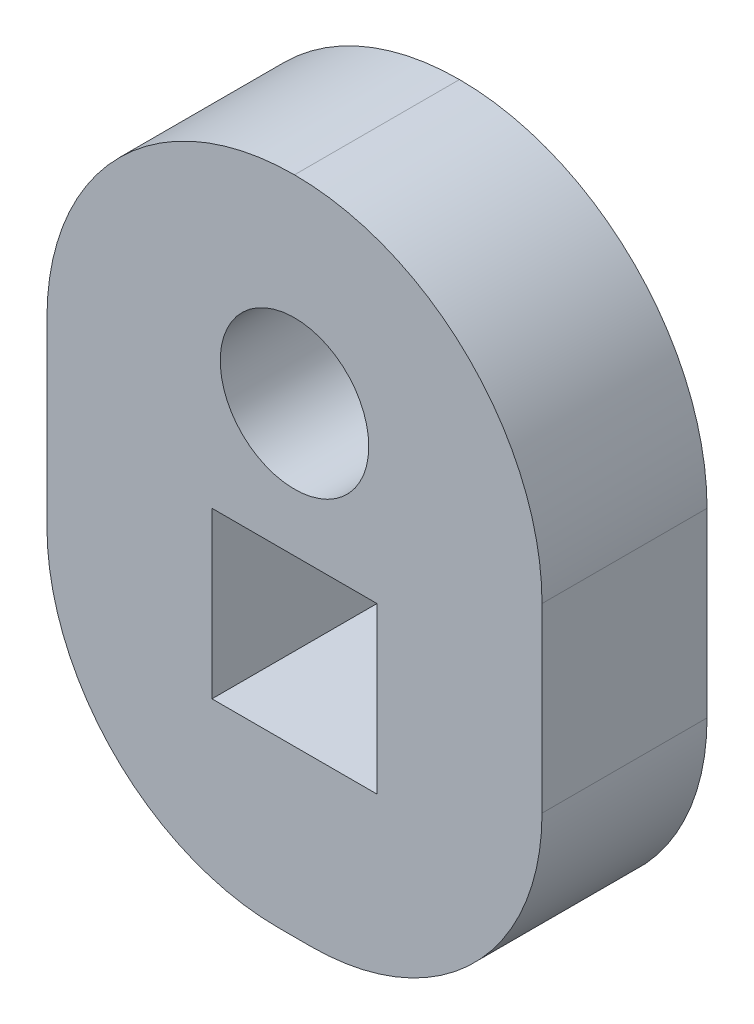
ISO-10303-21;
HEADER;
FILE_DESCRIPTION(('STEP AP214'),'2;1');
FILE_NAME('part.step','',(''),(''),'','','');
FILE_SCHEMA(('AUTOMOTIVE_DESIGN { 1 0 10303 214 1 1 1 1 }'));
ENDSEC;
DATA;
#1=APPLICATION_CONTEXT('core data for automotive mechanical design processes');
#2=APPLICATION_PROTOCOL_DEFINITION('international standard','automotive_design',2000,#1);
#3=PRODUCT_CONTEXT('',#1,'mechanical');
#4=PRODUCT('Part','Part','',(#3));
#5=PRODUCT_RELATED_PRODUCT_CATEGORY('part','',(#4));
#6=PRODUCT_DEFINITION_FORMATION('','',#4);
#7=PRODUCT_DEFINITION_CONTEXT('part definition',#1,'design');
#8=PRODUCT_DEFINITION('design','',#6,#7);
#9=PRODUCT_DEFINITION_SHAPE('','',#8);
#10=(LENGTH_UNIT() NAMED_UNIT(*) SI_UNIT(.MILLI.,.METRE.));
#11=(NAMED_UNIT(*) PLANE_ANGLE_UNIT() SI_UNIT($,.RADIAN.));
#12=(NAMED_UNIT(*) SI_UNIT($,.STERADIAN.) SOLID_ANGLE_UNIT());
#13=UNCERTAINTY_MEASURE_WITH_UNIT(LENGTH_MEASURE(1.E-05),#10,'distance_accuracy_value','');
#14=(GEOMETRIC_REPRESENTATION_CONTEXT(3) GLOBAL_UNCERTAINTY_ASSIGNED_CONTEXT((#13)) GLOBAL_UNIT_ASSIGNED_CONTEXT((#10,
#11,#12)) REPRESENTATION_CONTEXT('',''));
#15=CARTESIAN_POINT('',(0.,0.,0.));
#16=DIRECTION('',(0.,0.,1.));
#17=DIRECTION('',(1.,0.,0.));
#18=AXIS2_PLACEMENT_3D('',#15,#16,#17);
#19=CARTESIAN_POINT('',(-45.4776633747121,-31.8272946859904,5.));
#20=DIRECTION('',(0.,0.,1.));
#21=DIRECTION('',(1.,0.,0.));
#22=AXIS2_PLACEMENT_3D('',#19,#20,#21);
#23=CYLINDRICAL_SURFACE('',#22,7.5);
#24=DIRECTION('',(0.,0.,1.));
#25=VECTOR('',#24,1.);
#26=CARTESIAN_POINT('',(-37.9776633747121,-31.8272946859904,5.));
#27=LINE('',#26,#25);
#28=CARTESIAN_POINT('',(-37.9776633747121,-31.8272946859904,0.));
#29=VERTEX_POINT('',#28);
#30=CARTESIAN_POINT('',(-37.9776633747121,-31.8272946859904,5.));
#31=VERTEX_POINT('',#30);
#32=EDGE_CURVE('E187',#29,#31,#27,.T.);
#33=ORIENTED_EDGE('',*,*,#32,.F.);
#34=CARTESIAN_POINT('',(-45.4776633747121,-31.8272946859904,0.));
#35=DIRECTION('',(0.,0.,1.));
#36=DIRECTION('',(1.,0.,0.));
#37=AXIS2_PLACEMENT_3D('',#34,#35,#36);
#38=CIRCLE('',#37,7.5);
#39=CARTESIAN_POINT('',(-45.4776633747121,-24.3272946859903,0.));
#40=VERTEX_POINT('',#39);
#41=EDGE_CURVE('E190',#40,#29,#38,.F.);
#42=ORIENTED_EDGE('',*,*,#41,.F.);
#43=DIRECTION('',(0.,0.,-1.));
#44=VECTOR('',#43,1.);
#45=CARTESIAN_POINT('',(-45.4776633747121,-24.3272946859903,5.));
#46=LINE('',#45,#44);
#47=CARTESIAN_POINT('',(-45.4776633747121,-24.3272946859903,5.));
#48=VERTEX_POINT('',#47);
#49=EDGE_CURVE('E179',#40,#48,#46,.F.);
#50=ORIENTED_EDGE('',*,*,#49,.T.);
#51=CARTESIAN_POINT('',(-45.4776633747121,-31.8272946859904,5.));
#52=DIRECTION('',(0.,0.,1.));
#53=DIRECTION('',(1.,0.,0.));
#54=AXIS2_PLACEMENT_3D('',#51,#52,#53);
#55=CIRCLE('',#54,7.5);
#56=EDGE_CURVE('E193',#31,#48,#55,.T.);
#57=ORIENTED_EDGE('',*,*,#56,.F.);
#58=EDGE_LOOP('',(#33,#42,#50,#57));
#59=FACE_BOUND('',#58,.T.);
#60=ADVANCED_FACE('F33',(#59),#23,.T.);
#61=CARTESIAN_POINT('',(-45.4776633747121,-31.8272946859904,5.));
#62=DIRECTION('',(0.,0.,-1.));
#63=DIRECTION('',(-1.,0.,0.));
#64=AXIS2_PLACEMENT_3D('',#61,#62,#63);
#65=CYLINDRICAL_SURFACE('',#64,7.5);
#66=DIRECTION('',(0.,0.,-1.));
#67=VECTOR('',#66,1.);
#68=CARTESIAN_POINT('',(-52.9776633747121,-31.8272946859904,5.));
#69=LINE('',#68,#67);
#70=CARTESIAN_POINT('',(-52.9776633747121,-31.8272946859904,5.));
#71=VERTEX_POINT('',#70);
#72=CARTESIAN_POINT('',(-52.9776633747121,-31.8272946859904,0.));
#73=VERTEX_POINT('',#72);
#74=EDGE_CURVE('E172',#71,#73,#69,.T.);
#75=ORIENTED_EDGE('',*,*,#74,.F.);
#76=CARTESIAN_POINT('',(-45.4776633747121,-31.8272946859904,5.));
#77=DIRECTION('',(0.,0.,1.));
#78=DIRECTION('',(1.,0.,0.));
#79=AXIS2_PLACEMENT_3D('',#76,#77,#78);
#80=CIRCLE('',#79,7.5);
#81=EDGE_CURVE('E182',#48,#71,#80,.T.);
#82=ORIENTED_EDGE('',*,*,#81,.F.);
#83=ORIENTED_EDGE('',*,*,#49,.F.);
#84=CARTESIAN_POINT('',(-45.4776633747121,-31.8272946859904,0.));
#85=DIRECTION('',(0.,0.,1.));
#86=DIRECTION('',(1.,0.,0.));
#87=AXIS2_PLACEMENT_3D('',#84,#85,#86);
#88=CIRCLE('',#87,7.5);
#89=EDGE_CURVE('E184',#73,#40,#88,.F.);
#90=ORIENTED_EDGE('',*,*,#89,.F.);
#91=EDGE_LOOP('',(#75,#82,#83,#90));
#92=FACE_BOUND('',#91,.T.);
#93=ADVANCED_FACE('F231',(#92),#65,.T.);
#94=CARTESIAN_POINT('',(0.,0.,5.));
#95=DIRECTION('',(0.,0.,1.));
#96=DIRECTION('',(1.,0.,0.));
#97=AXIS2_PLACEMENT_3D('',#94,#95,#96);
#98=PLANE('',#97);
#99=CARTESIAN_POINT('',(-45.4776633747121,-30.3272946859904,5.));
#100=DIRECTION('',(0.,0.,1.));
#101=DIRECTION('',(1.,0.,0.));
#102=AXIS2_PLACEMENT_3D('',#99,#100,#101);
#103=CIRCLE('',#102,2.25);
#104=CARTESIAN_POINT('',(-43.2276633747121,-30.3272946859904,5.));
#105=VERTEX_POINT('',#104);
#106=EDGE_CURVE('E148',#105,#105,#103,.T.);
#107=ORIENTED_EDGE('',*,*,#106,.F.);
#108=EDGE_LOOP('',(#107));
#109=FACE_BOUND('',#108,.T.);
#110=DIRECTION('',(1.,0.,0.));
#111=VECTOR('',#110,1.);
#112=CARTESIAN_POINT('',(-52.9776633747121,-44.3272946859904,5.));
#113=LINE('',#112,#111);
#114=CARTESIAN_POINT('',(-45.9776633747121,-44.3272946859904,5.));
#115=VERTEX_POINT('',#114);
#116=CARTESIAN_POINT('',(-44.9776633747121,-44.3272946859904,5.));
#117=VERTEX_POINT('',#116);
#118=EDGE_CURVE('E167',#115,#117,#113,.T.);
#119=ORIENTED_EDGE('',*,*,#118,.T.);
#120=CARTESIAN_POINT('',(-44.9776633747121,-37.3272946859904,5.));
#121=DIRECTION('',(0.,0.,1.));
#122=DIRECTION('',(1.,0.,0.));
#123=AXIS2_PLACEMENT_3D('',#120,#121,#122);
#124=CIRCLE('',#123,7.);
#125=CARTESIAN_POINT('',(-37.9776633747121,-37.3272946859904,5.));
#126=VERTEX_POINT('',#125);
#127=EDGE_CURVE('E41',#117,#126,#124,.T.);
#128=ORIENTED_EDGE('',*,*,#127,.T.);
#129=DIRECTION('',(0.,1.,0.));
#130=VECTOR('',#129,1.);
#131=CARTESIAN_POINT('',(-37.9776633747121,-24.3272946859903,5.));
#132=LINE('',#131,#130);
#133=EDGE_CURVE('E170',#126,#31,#132,.T.);
#134=ORIENTED_EDGE('',*,*,#133,.T.);
#135=ORIENTED_EDGE('',*,*,#56,.T.);
#136=ORIENTED_EDGE('',*,*,#81,.T.);
#137=DIRECTION('',(0.,-1.,0.));
#138=VECTOR('',#137,1.);
#139=CARTESIAN_POINT('',(-52.9776633747121,-24.3272946859903,5.));
#140=LINE('',#139,#138);
#141=CARTESIAN_POINT('',(-52.9776633747121,-37.3272946859904,5.));
#142=VERTEX_POINT('',#141);
#143=EDGE_CURVE('E165',#71,#142,#140,.T.);
#144=ORIENTED_EDGE('',*,*,#143,.T.);
#145=CARTESIAN_POINT('',(-45.9776633747121,-37.3272946859904,5.));
#146=DIRECTION('',(0.,0.,1.));
#147=DIRECTION('',(1.,0.,0.));
#148=AXIS2_PLACEMENT_3D('',#145,#146,#147);
#149=CIRCLE('',#148,7.);
#150=EDGE_CURVE('E206',#142,#115,#149,.T.);
#151=ORIENTED_EDGE('',*,*,#150,.T.);
#152=EDGE_LOOP('',(#119,#128,#134,#135,#136,#144,#151));
#153=FACE_BOUND('',#152,.T.);
#154=DIRECTION('',(1.,0.,0.));
#155=VECTOR('',#154,1.);
#156=CARTESIAN_POINT('',(0.,-34.3272946859904,5.));
#157=LINE('',#156,#155);
#158=CARTESIAN_POINT('',(-47.9776633747121,-34.3272946859904,5.));
#159=VERTEX_POINT('',#158);
#160=CARTESIAN_POINT('',(-42.9776633747121,-34.3272946859904,5.));
#161=VERTEX_POINT('',#160);
#162=EDGE_CURVE('E154',#159,#161,#157,.T.);
#163=ORIENTED_EDGE('',*,*,#162,.T.);
#164=DIRECTION('',(0.,-1.,0.));
#165=VECTOR('',#164,1.);
#166=CARTESIAN_POINT('',(-42.9776633747121,0.,5.));
#167=LINE('',#166,#165);
#168=CARTESIAN_POINT('',(-42.9776633747121,-39.3272946859904,5.));
#169=VERTEX_POINT('',#168);
#170=EDGE_CURVE('E136',#161,#169,#167,.T.);
#171=ORIENTED_EDGE('',*,*,#170,.T.);
#172=DIRECTION('',(1.,0.,0.));
#173=VECTOR('',#172,1.);
#174=CARTESIAN_POINT('',(0.,-39.3272946859904,5.));
#175=LINE('',#174,#173);
#176=CARTESIAN_POINT('',(-47.9776633747121,-39.3272946859904,5.));
#177=VERTEX_POINT('',#176);
#178=EDGE_CURVE('E142',#177,#169,#175,.T.);
#179=ORIENTED_EDGE('',*,*,#178,.F.);
#180=DIRECTION('',(0.,-1.,0.));
#181=VECTOR('',#180,1.);
#182=CARTESIAN_POINT('',(-47.9776633747121,0.,5.));
#183=LINE('',#182,#181);
#184=EDGE_CURVE('E145',#159,#177,#183,.T.);
#185=ORIENTED_EDGE('',*,*,#184,.F.);
#186=EDGE_LOOP('',(#163,#171,#179,#185));
#187=FACE_BOUND('',#186,.T.);
#188=ADVANCED_FACE('F210',(#109,#153,#187),#98,.T.);
#189=CARTESIAN_POINT('',(0.,0.,0.));
#190=DIRECTION('',(0.,0.,1.));
#191=DIRECTION('',(1.,0.,0.));
#192=AXIS2_PLACEMENT_3D('',#189,#190,#191);
#193=PLANE('',#192);
#194=CARTESIAN_POINT('',(-45.4776633747121,-30.3272946859904,0.));
#195=DIRECTION('',(0.,0.,1.));
#196=DIRECTION('',(1.,0.,0.));
#197=AXIS2_PLACEMENT_3D('',#194,#195,#196);
#198=CIRCLE('',#197,2.25);
#199=CARTESIAN_POINT('',(-43.2276633747121,-30.3272946859904,0.));
#200=VERTEX_POINT('',#199);
#201=EDGE_CURVE('E155',#200,#200,#198,.T.);
#202=ORIENTED_EDGE('',*,*,#201,.T.);
#203=EDGE_LOOP('',(#202));
#204=FACE_BOUND('',#203,.T.);
#205=DIRECTION('',(0.,1.,0.));
#206=VECTOR('',#205,1.);
#207=CARTESIAN_POINT('',(-37.9776633747121,-24.3272946859903,0.));
#208=LINE('',#207,#206);
#209=CARTESIAN_POINT('',(-37.9776633747121,-37.3272946859904,0.));
#210=VERTEX_POINT('',#209);
#211=EDGE_CURVE('E168',#210,#29,#208,.T.);
#212=ORIENTED_EDGE('',*,*,#211,.F.);
#213=CARTESIAN_POINT('',(-44.9776633747121,-37.3272946859904,0.));
#214=DIRECTION('',(0.,0.,1.));
#215=DIRECTION('',(1.,0.,0.));
#216=AXIS2_PLACEMENT_3D('',#213,#214,#215);
#217=CIRCLE('',#216,7.);
#218=CARTESIAN_POINT('',(-44.9776633747121,-44.3272946859904,0.));
#219=VERTEX_POINT('',#218);
#220=EDGE_CURVE('E200',#210,#219,#217,.F.);
#221=ORIENTED_EDGE('',*,*,#220,.T.);
#222=DIRECTION('',(1.,0.,0.));
#223=VECTOR('',#222,1.);
#224=CARTESIAN_POINT('',(-52.9776633747121,-44.3272946859904,0.));
#225=LINE('',#224,#223);
#226=CARTESIAN_POINT('',(-45.9776633747121,-44.3272946859904,0.));
#227=VERTEX_POINT('',#226);
#228=EDGE_CURVE('E174',#227,#219,#225,.T.);
#229=ORIENTED_EDGE('',*,*,#228,.F.);
#230=CARTESIAN_POINT('',(-45.9776633747121,-37.3272946859904,0.));
#231=DIRECTION('',(0.,0.,1.));
#232=DIRECTION('',(1.,0.,0.));
#233=AXIS2_PLACEMENT_3D('',#230,#231,#232);
#234=CIRCLE('',#233,7.);
#235=CARTESIAN_POINT('',(-52.9776633747121,-37.3272946859904,0.));
#236=VERTEX_POINT('',#235);
#237=EDGE_CURVE('E198',#227,#236,#234,.F.);
#238=ORIENTED_EDGE('',*,*,#237,.T.);
#239=DIRECTION('',(0.,-1.,0.));
#240=VECTOR('',#239,1.);
#241=CARTESIAN_POINT('',(-52.9776633747121,-24.3272946859903,0.));
#242=LINE('',#241,#240);
#243=EDGE_CURVE('E161',#73,#236,#242,.T.);
#244=ORIENTED_EDGE('',*,*,#243,.F.);
#245=ORIENTED_EDGE('',*,*,#89,.T.);
#246=ORIENTED_EDGE('',*,*,#41,.T.);
#247=EDGE_LOOP('',(#212,#221,#229,#238,#244,#245,#246));
#248=FACE_BOUND('',#247,.T.);
#249=DIRECTION('',(0.,-1.,0.));
#250=VECTOR('',#249,1.);
#251=CARTESIAN_POINT('',(-42.9776633747121,0.,0.));
#252=LINE('',#251,#250);
#253=CARTESIAN_POINT('',(-42.9776633747121,-34.3272946859904,0.));
#254=VERTEX_POINT('',#253);
#255=CARTESIAN_POINT('',(-42.9776633747121,-39.3272946859904,0.));
#256=VERTEX_POINT('',#255);
#257=EDGE_CURVE('E130',#254,#256,#252,.T.);
#258=ORIENTED_EDGE('',*,*,#257,.F.);
#259=DIRECTION('',(1.,0.,0.));
#260=VECTOR('',#259,1.);
#261=CARTESIAN_POINT('',(0.,-34.3272946859904,0.));
#262=LINE('',#261,#260);
#263=CARTESIAN_POINT('',(-47.9776633747121,-34.3272946859904,0.));
#264=VERTEX_POINT('',#263);
#265=EDGE_CURVE('E119',#264,#254,#262,.T.);
#266=ORIENTED_EDGE('',*,*,#265,.F.);
#267=DIRECTION('',(0.,-1.,0.));
#268=VECTOR('',#267,1.);
#269=CARTESIAN_POINT('',(-47.9776633747121,0.,0.));
#270=LINE('',#269,#268);
#271=CARTESIAN_POINT('',(-47.9776633747121,-39.3272946859904,0.));
#272=VERTEX_POINT('',#271);
#273=EDGE_CURVE('E129',#264,#272,#270,.T.);
#274=ORIENTED_EDGE('',*,*,#273,.T.);
#275=DIRECTION('',(1.,0.,0.));
#276=VECTOR('',#275,1.);
#277=CARTESIAN_POINT('',(0.,-39.3272946859904,0.));
#278=LINE('',#277,#276);
#279=EDGE_CURVE('E137',#272,#256,#278,.T.);
#280=ORIENTED_EDGE('',*,*,#279,.T.);
#281=EDGE_LOOP('',(#258,#266,#274,#280));
#282=FACE_BOUND('',#281,.T.);
#283=ADVANCED_FACE('F140',(#204,#248,#282),#193,.F.);
#284=CARTESIAN_POINT('',(-52.9776633747121,-24.3272946859903,5.));
#285=DIRECTION('',(1.,0.,0.));
#286=DIRECTION('',(0.,0.,-1.));
#287=AXIS2_PLACEMENT_3D('',#284,#285,#286);
#288=PLANE('',#287);
#289=ORIENTED_EDGE('',*,*,#243,.T.);
#290=DIRECTION('',(0.,0.,-1.));
#291=VECTOR('',#290,1.);
#292=CARTESIAN_POINT('',(-52.9776633747121,-37.3272946859904,5.));
#293=LINE('',#292,#291);
#294=EDGE_CURVE('E11',#236,#142,#293,.F.);
#295=ORIENTED_EDGE('',*,*,#294,.T.);
#296=ORIENTED_EDGE('',*,*,#143,.F.);
#297=ORIENTED_EDGE('',*,*,#74,.T.);
#298=EDGE_LOOP('',(#289,#295,#296,#297));
#299=FACE_BOUND('',#298,.T.);
#300=ADVANCED_FACE('F227',(#299),#288,.F.);
#301=CARTESIAN_POINT('',(-52.9776633747121,-44.3272946859904,5.));
#302=DIRECTION('',(0.,1.,0.));
#303=DIRECTION('',(0.,0.,1.));
#304=AXIS2_PLACEMENT_3D('',#301,#302,#303);
#305=PLANE('',#304);
#306=ORIENTED_EDGE('',*,*,#228,.T.);
#307=DIRECTION('',(0.,0.,-1.));
#308=VECTOR('',#307,1.);
#309=CARTESIAN_POINT('',(-44.9776633747121,-44.3272946859904,5.));
#310=LINE('',#309,#308);
#311=EDGE_CURVE('E54',#219,#117,#310,.F.);
#312=ORIENTED_EDGE('',*,*,#311,.T.);
#313=ORIENTED_EDGE('',*,*,#118,.F.);
#314=DIRECTION('',(0.,0.,-1.));
#315=VECTOR('',#314,1.);
#316=CARTESIAN_POINT('',(-45.9776633747121,-44.3272946859904,5.));
#317=LINE('',#316,#315);
#318=EDGE_CURVE('E202',#115,#227,#317,.T.);
#319=ORIENTED_EDGE('',*,*,#318,.T.);
#320=EDGE_LOOP('',(#306,#312,#313,#319));
#321=FACE_BOUND('',#320,.T.);
#322=ADVANCED_FACE('F222',(#321),#305,.F.);
#323=CARTESIAN_POINT('',(-37.9776633747121,-24.3272946859903,5.));
#324=DIRECTION('',(-1.,0.,0.));
#325=DIRECTION('',(0.,-1.,0.));
#326=AXIS2_PLACEMENT_3D('',#323,#324,#325);
#327=PLANE('',#326);
#328=ORIENTED_EDGE('',*,*,#133,.F.);
#329=DIRECTION('',(0.,0.,-1.));
#330=VECTOR('',#329,1.);
#331=CARTESIAN_POINT('',(-37.9776633747121,-37.3272946859904,5.));
#332=LINE('',#331,#330);
#333=EDGE_CURVE('E195',#126,#210,#332,.T.);
#334=ORIENTED_EDGE('',*,*,#333,.T.);
#335=ORIENTED_EDGE('',*,*,#211,.T.);
#336=ORIENTED_EDGE('',*,*,#32,.T.);
#337=EDGE_LOOP('',(#328,#334,#335,#336));
#338=FACE_BOUND('',#337,.T.);
#339=ADVANCED_FACE('F216',(#338),#327,.F.);
#340=CARTESIAN_POINT('',(-42.9776633747121,0.,0.));
#341=DIRECTION('',(-1.,0.,0.));
#342=DIRECTION('',(0.,0.,1.));
#343=AXIS2_PLACEMENT_3D('',#340,#341,#342);
#344=PLANE('',#343);
#345=ORIENTED_EDGE('',*,*,#170,.F.);
#346=DIRECTION('',(0.,0.,1.));
#347=VECTOR('',#346,1.);
#348=CARTESIAN_POINT('',(-42.9776633747121,-34.3272946859904,0.));
#349=LINE('',#348,#347);
#350=EDGE_CURVE('E123',#254,#161,#349,.T.);
#351=ORIENTED_EDGE('',*,*,#350,.F.);
#352=ORIENTED_EDGE('',*,*,#257,.T.);
#353=DIRECTION('',(0.,0.,1.));
#354=VECTOR('',#353,1.);
#355=CARTESIAN_POINT('',(-42.9776633747121,-39.3272946859904,0.));
#356=LINE('',#355,#354);
#357=EDGE_CURVE('E159',#256,#169,#356,.T.);
#358=ORIENTED_EDGE('',*,*,#357,.T.);
#359=EDGE_LOOP('',(#345,#351,#352,#358));
#360=FACE_BOUND('',#359,.T.);
#361=ADVANCED_FACE('F133',(#360),#344,.T.);
#362=CARTESIAN_POINT('',(0.,-39.3272946859904,0.));
#363=DIRECTION('',(0.,-1.,0.));
#364=DIRECTION('',(0.,0.,-1.));
#365=AXIS2_PLACEMENT_3D('',#362,#363,#364);
#366=PLANE('',#365);
#367=ORIENTED_EDGE('',*,*,#178,.T.);
#368=ORIENTED_EDGE('',*,*,#357,.F.);
#369=ORIENTED_EDGE('',*,*,#279,.F.);
#370=DIRECTION('',(0.,0.,1.));
#371=VECTOR('',#370,1.);
#372=CARTESIAN_POINT('',(-47.9776633747121,-39.3272946859904,0.));
#373=LINE('',#372,#371);
#374=EDGE_CURVE('E162',#272,#177,#373,.T.);
#375=ORIENTED_EDGE('',*,*,#374,.T.);
#376=EDGE_LOOP('',(#367,#368,#369,#375));
#377=FACE_BOUND('',#376,.T.);
#378=ADVANCED_FACE('F257',(#377),#366,.F.);
#379=CARTESIAN_POINT('',(-47.9776633747121,0.,0.));
#380=DIRECTION('',(-1.,0.,0.));
#381=DIRECTION('',(0.,0.,1.));
#382=AXIS2_PLACEMENT_3D('',#379,#380,#381);
#383=PLANE('',#382);
#384=ORIENTED_EDGE('',*,*,#184,.T.);
#385=ORIENTED_EDGE('',*,*,#374,.F.);
#386=ORIENTED_EDGE('',*,*,#273,.F.);
#387=DIRECTION('',(0.,0.,1.));
#388=VECTOR('',#387,1.);
#389=CARTESIAN_POINT('',(-47.9776633747121,-34.3272946859904,0.));
#390=LINE('',#389,#388);
#391=EDGE_CURVE('E125',#264,#159,#390,.T.);
#392=ORIENTED_EDGE('',*,*,#391,.T.);
#393=EDGE_LOOP('',(#384,#385,#386,#392));
#394=FACE_BOUND('',#393,.T.);
#395=ADVANCED_FACE('F252',(#394),#383,.F.);
#396=CARTESIAN_POINT('',(0.,-34.3272946859904,0.));
#397=DIRECTION('',(0.,-1.,0.));
#398=DIRECTION('',(0.,0.,-1.));
#399=AXIS2_PLACEMENT_3D('',#396,#397,#398);
#400=PLANE('',#399);
#401=ORIENTED_EDGE('',*,*,#162,.F.);
#402=ORIENTED_EDGE('',*,*,#391,.F.);
#403=ORIENTED_EDGE('',*,*,#265,.T.);
#404=ORIENTED_EDGE('',*,*,#350,.T.);
#405=EDGE_LOOP('',(#401,#402,#403,#404));
#406=FACE_BOUND('',#405,.T.);
#407=ADVANCED_FACE('F122',(#406),#400,.T.);
#408=CARTESIAN_POINT('',(-45.4776633747121,-30.3272946859904,0.));
#409=DIRECTION('',(0.,0.,1.));
#410=DIRECTION('',(1.,0.,0.));
#411=AXIS2_PLACEMENT_3D('',#408,#409,#410);
#412=CYLINDRICAL_SURFACE('',#411,2.25);
#413=ORIENTED_EDGE('',*,*,#201,.F.);
#414=EDGE_LOOP('',(#413));
#415=FACE_BOUND('',#414,.T.);
#416=ORIENTED_EDGE('',*,*,#106,.T.);
#417=EDGE_LOOP('',(#416));
#418=FACE_BOUND('',#417,.T.);
#419=ADVANCED_FACE('F242',(#415,#418),#412,.F.);
#420=CARTESIAN_POINT('',(-44.9776633747121,-37.3272946859904,5.));
#421=DIRECTION('',(0.,0.,-1.));
#422=DIRECTION('',(-1.,0.,0.));
#423=AXIS2_PLACEMENT_3D('',#420,#421,#422);
#424=CYLINDRICAL_SURFACE('',#423,7.);
#425=ORIENTED_EDGE('',*,*,#127,.F.);
#426=ORIENTED_EDGE('',*,*,#311,.F.);
#427=ORIENTED_EDGE('',*,*,#220,.F.);
#428=ORIENTED_EDGE('',*,*,#333,.F.);
#429=EDGE_LOOP('',(#425,#426,#427,#428));
#430=FACE_BOUND('',#429,.T.);
#431=ADVANCED_FACE('F219',(#430),#424,.T.);
#432=CARTESIAN_POINT('',(-45.9776633747121,-37.3272946859904,5.));
#433=DIRECTION('',(0.,0.,-1.));
#434=DIRECTION('',(-1.,0.,0.));
#435=AXIS2_PLACEMENT_3D('',#432,#433,#434);
#436=CYLINDRICAL_SURFACE('',#435,7.);
#437=ORIENTED_EDGE('',*,*,#150,.F.);
#438=ORIENTED_EDGE('',*,*,#294,.F.);
#439=ORIENTED_EDGE('',*,*,#237,.F.);
#440=ORIENTED_EDGE('',*,*,#318,.F.);
#441=EDGE_LOOP('',(#437,#438,#439,#440));
#442=FACE_BOUND('',#441,.T.);
#443=ADVANCED_FACE('F35',(#442),#436,.T.);
#444=CLOSED_SHELL('',(#60,#93,#188,#283,#300,#322,#339,#361,#378,#395,#407,#419,#431,#443));
#445=MANIFOLD_SOLID_BREP('B2',#444);
#446=ADVANCED_BREP_SHAPE_REPRESENTATION('',(#18,#445),#14);
#447=SHAPE_DEFINITION_REPRESENTATION(#9,#446);
ENDSEC;
END-ISO-10303-21;
